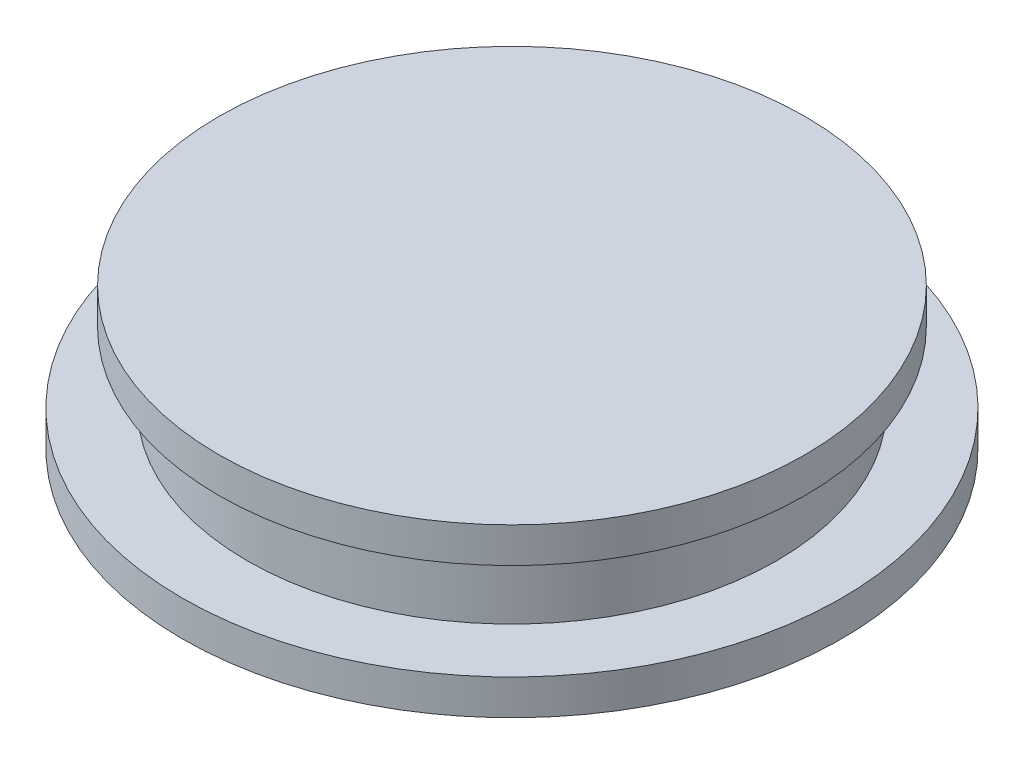
ISO-10303-21;
HEADER;
FILE_DESCRIPTION(('STEP AP214'),'2;1');
FILE_NAME('part.step','',(''),(''),'','','');
FILE_SCHEMA(('AUTOMOTIVE_DESIGN { 1 0 10303 214 1 1 1 1 }'));
ENDSEC;
DATA;
#1=APPLICATION_CONTEXT('core data for automotive mechanical design processes');
#2=APPLICATION_PROTOCOL_DEFINITION('international standard','automotive_design',2000,#1);
#3=PRODUCT_CONTEXT('',#1,'mechanical');
#4=PRODUCT('Part','Part','',(#3));
#5=PRODUCT_RELATED_PRODUCT_CATEGORY('part','',(#4));
#6=PRODUCT_DEFINITION_FORMATION('','',#4);
#7=PRODUCT_DEFINITION_CONTEXT('part definition',#1,'design');
#8=PRODUCT_DEFINITION('design','',#6,#7);
#9=PRODUCT_DEFINITION_SHAPE('','',#8);
#10=(LENGTH_UNIT() NAMED_UNIT(*) SI_UNIT(.MILLI.,.METRE.));
#11=(NAMED_UNIT(*) PLANE_ANGLE_UNIT() SI_UNIT($,.RADIAN.));
#12=(NAMED_UNIT(*) SI_UNIT($,.STERADIAN.) SOLID_ANGLE_UNIT());
#13=UNCERTAINTY_MEASURE_WITH_UNIT(LENGTH_MEASURE(1.E-05),#10,'distance_accuracy_value','');
#14=(GEOMETRIC_REPRESENTATION_CONTEXT(3) GLOBAL_UNCERTAINTY_ASSIGNED_CONTEXT((#13)) GLOBAL_UNIT_ASSIGNED_CONTEXT((#10,
#11,#12)) REPRESENTATION_CONTEXT('',''));
#15=CARTESIAN_POINT('',(0.,0.,0.));
#16=DIRECTION('',(0.,0.,1.));
#17=DIRECTION('',(1.,0.,0.));
#18=AXIS2_PLACEMENT_3D('',#15,#16,#17);
#19=CARTESIAN_POINT('',(0.,2.,0.));
#20=DIRECTION('',(0.,-1.,0.));
#21=DIRECTION('',(0.,0.,-1.));
#22=AXIS2_PLACEMENT_3D('',#19,#20,#21);
#23=CYLINDRICAL_SURFACE('',#22,18.669);
#24=CARTESIAN_POINT('',(0.,2.,0.));
#25=DIRECTION('',(0.,1.,0.));
#26=DIRECTION('',(0.,0.,1.));
#27=AXIS2_PLACEMENT_3D('',#24,#25,#26);
#28=CIRCLE('',#27,18.669);
#29=CARTESIAN_POINT('',(0.,2.,18.669));
#30=VERTEX_POINT('',#29);
#31=EDGE_CURVE('E48',#30,#30,#28,.T.);
#32=ORIENTED_EDGE('',*,*,#31,.F.);
#33=EDGE_LOOP('',(#32));
#34=FACE_BOUND('',#33,.T.);
#35=CARTESIAN_POINT('',(0.,0.,0.));
#36=DIRECTION('',(0.,1.,0.));
#37=DIRECTION('',(0.,0.,1.));
#38=AXIS2_PLACEMENT_3D('',#35,#36,#37);
#39=CIRCLE('',#38,18.669);
#40=CARTESIAN_POINT('',(0.,0.,18.669));
#41=VERTEX_POINT('',#40);
#42=EDGE_CURVE('E42',#41,#41,#39,.T.);
#43=ORIENTED_EDGE('',*,*,#42,.T.);
#44=EDGE_LOOP('',(#43));
#45=FACE_BOUND('',#44,.T.);
#46=ADVANCED_FACE('F39',(#34,#45),#23,.T.);
#47=CARTESIAN_POINT('',(0.,2.,0.));
#48=DIRECTION('',(0.,1.,0.));
#49=DIRECTION('',(0.,0.,1.));
#50=AXIS2_PLACEMENT_3D('',#47,#48,#49);
#51=PLANE('',#50);
#52=CARTESIAN_POINT('',(0.,2.,0.));
#53=DIRECTION('',(0.,1.,0.));
#54=DIRECTION('',(0.,0.,1.));
#55=AXIS2_PLACEMENT_3D('',#52,#53,#54);
#56=CIRCLE('',#55,15.);
#57=CARTESIAN_POINT('',(0.,2.,15.));
#58=VERTEX_POINT('',#57);
#59=EDGE_CURVE('E11',#58,#58,#56,.T.);
#60=ORIENTED_EDGE('',*,*,#59,.F.);
#61=EDGE_LOOP('',(#60));
#62=FACE_BOUND('',#61,.T.);
#63=ORIENTED_EDGE('',*,*,#31,.T.);
#64=EDGE_LOOP('',(#63));
#65=FACE_BOUND('',#64,.T.);
#66=ADVANCED_FACE('F225',(#62,#65),#51,.T.);
#67=CARTESIAN_POINT('',(0.,0.,0.));
#68=DIRECTION('',(0.,1.,0.));
#69=DIRECTION('',(0.,0.,1.));
#70=AXIS2_PLACEMENT_3D('',#67,#68,#69);
#71=PLANE('',#70);
#72=ORIENTED_EDGE('',*,*,#42,.F.);
#73=EDGE_LOOP('',(#72));
#74=FACE_BOUND('',#73,.T.);
#75=DIRECTION('',(0.,0.,1.));
#76=VECTOR('',#75,1.);
#77=CARTESIAN_POINT('',(5.461,0.,-5.461));
#78=LINE('',#77,#76);
#79=CARTESIAN_POINT('',(5.461,0.,-5.461));
#80=VERTEX_POINT('',#79);
#81=CARTESIAN_POINT('',(5.461,0.,5.461));
#82=VERTEX_POINT('',#81);
#83=EDGE_CURVE('E114',#80,#82,#78,.T.);
#84=ORIENTED_EDGE('',*,*,#83,.F.);
#85=DIRECTION('',(1.,0.,0.));
#86=VECTOR('',#85,1.);
#87=CARTESIAN_POINT('',(-5.461,0.,-5.461));
#88=LINE('',#87,#86);
#89=CARTESIAN_POINT('',(-5.461,0.,-5.461));
#90=VERTEX_POINT('',#89);
#91=EDGE_CURVE('E135',#90,#80,#88,.T.);
#92=ORIENTED_EDGE('',*,*,#91,.F.);
#93=DIRECTION('',(0.,0.,-1.));
#94=VECTOR('',#93,1.);
#95=CARTESIAN_POINT('',(-5.461,0.,-5.461));
#96=LINE('',#95,#94);
#97=CARTESIAN_POINT('',(-5.461,0.,5.461));
#98=VERTEX_POINT('',#97);
#99=EDGE_CURVE('E139',#98,#90,#96,.T.);
#100=ORIENTED_EDGE('',*,*,#99,.F.);
#101=DIRECTION('',(-1.,0.,0.));
#102=VECTOR('',#101,1.);
#103=CARTESIAN_POINT('',(-5.461,0.,5.461));
#104=LINE('',#103,#102);
#105=EDGE_CURVE('E148',#82,#98,#104,.T.);
#106=ORIENTED_EDGE('',*,*,#105,.F.);
#107=EDGE_LOOP('',(#84,#92,#100,#106));
#108=FACE_BOUND('',#107,.T.);
#109=ADVANCED_FACE('F221',(#74,#108),#71,.F.);
#110=CARTESIAN_POINT('',(0.,6.,0.));
#111=DIRECTION('',(0.,-1.,0.));
#112=DIRECTION('',(0.,0.,-1.));
#113=AXIS2_PLACEMENT_3D('',#110,#111,#112);
#114=CYLINDRICAL_SURFACE('',#113,15.);
#115=CARTESIAN_POINT('',(0.,6.,0.));
#116=DIRECTION('',(0.,1.,0.));
#117=DIRECTION('',(0.,0.,1.));
#118=AXIS2_PLACEMENT_3D('',#115,#116,#117);
#119=CIRCLE('',#118,15.);
#120=CARTESIAN_POINT('',(0.,6.,15.));
#121=VERTEX_POINT('',#120);
#122=EDGE_CURVE('E206',#121,#121,#119,.T.);
#123=ORIENTED_EDGE('',*,*,#122,.F.);
#124=EDGE_LOOP('',(#123));
#125=FACE_BOUND('',#124,.T.);
#126=ORIENTED_EDGE('',*,*,#59,.T.);
#127=EDGE_LOOP('',(#126));
#128=FACE_BOUND('',#127,.T.);
#129=ADVANCED_FACE('F224',(#125,#128),#114,.T.);
#130=CARTESIAN_POINT('',(0.,8.,0.));
#131=DIRECTION('',(0.,-1.,0.));
#132=DIRECTION('',(0.,0.,-1.));
#133=AXIS2_PLACEMENT_3D('',#130,#131,#132);
#134=CYLINDRICAL_SURFACE('',#133,16.6);
#135=CARTESIAN_POINT('',(0.,8.,0.));
#136=DIRECTION('',(0.,1.,0.));
#137=DIRECTION('',(0.,0.,1.));
#138=AXIS2_PLACEMENT_3D('',#135,#136,#137);
#139=CIRCLE('',#138,16.6);
#140=CARTESIAN_POINT('',(0.,8.,16.6));
#141=VERTEX_POINT('',#140);
#142=EDGE_CURVE('E202',#141,#141,#139,.T.);
#143=ORIENTED_EDGE('',*,*,#142,.F.);
#144=EDGE_LOOP('',(#143));
#145=FACE_BOUND('',#144,.T.);
#146=CARTESIAN_POINT('',(0.,6.,0.));
#147=DIRECTION('',(0.,1.,0.));
#148=DIRECTION('',(0.,0.,1.));
#149=AXIS2_PLACEMENT_3D('',#146,#147,#148);
#150=CIRCLE('',#149,16.6);
#151=CARTESIAN_POINT('',(0.,6.,16.6));
#152=VERTEX_POINT('',#151);
#153=EDGE_CURVE('E193',#152,#152,#150,.T.);
#154=ORIENTED_EDGE('',*,*,#153,.T.);
#155=EDGE_LOOP('',(#154));
#156=FACE_BOUND('',#155,.T.);
#157=ADVANCED_FACE('F253',(#145,#156),#134,.T.);
#158=CARTESIAN_POINT('',(0.,8.,0.));
#159=DIRECTION('',(0.,1.,0.));
#160=DIRECTION('',(0.,0.,1.));
#161=AXIS2_PLACEMENT_3D('',#158,#159,#160);
#162=PLANE('',#161);
#163=ORIENTED_EDGE('',*,*,#142,.T.);
#164=EDGE_LOOP('',(#163));
#165=FACE_BOUND('',#164,.T.);
#166=ADVANCED_FACE('F257',(#165),#162,.T.);
#167=CARTESIAN_POINT('',(0.,6.,0.));
#168=DIRECTION('',(0.,1.,0.));
#169=DIRECTION('',(0.,0.,1.));
#170=AXIS2_PLACEMENT_3D('',#167,#168,#169);
#171=PLANE('',#170);
#172=ORIENTED_EDGE('',*,*,#122,.T.);
#173=EDGE_LOOP('',(#172));
#174=FACE_BOUND('',#173,.T.);
#175=ORIENTED_EDGE('',*,*,#153,.F.);
#176=EDGE_LOOP('',(#175));
#177=FACE_BOUND('',#176,.T.);
#178=ADVANCED_FACE('F259',(#174,#177),#171,.F.);
#179=CARTESIAN_POINT('',(0.,1.,0.));
#180=DIRECTION('',(0.,-1.,0.));
#181=DIRECTION('',(0.,0.,-1.));
#182=AXIS2_PLACEMENT_3D('',#179,#180,#181);
#183=PLANE('',#182);
#184=DIRECTION('',(1.,0.,0.));
#185=VECTOR('',#184,1.);
#186=CARTESIAN_POINT('',(-5.461,1.,-5.461));
#187=LINE('',#186,#185);
#188=CARTESIAN_POINT('',(-5.461,1.,-5.461));
#189=VERTEX_POINT('',#188);
#190=CARTESIAN_POINT('',(5.461,1.,-5.461));
#191=VERTEX_POINT('',#190);
#192=EDGE_CURVE('E120',#189,#191,#187,.T.);
#193=ORIENTED_EDGE('',*,*,#192,.T.);
#194=DIRECTION('',(0.,0.,1.));
#195=VECTOR('',#194,1.);
#196=CARTESIAN_POINT('',(5.461,1.,-5.461));
#197=LINE('',#196,#195);
#198=CARTESIAN_POINT('',(5.461,1.,5.461));
#199=VERTEX_POINT('',#198);
#200=EDGE_CURVE('E111',#191,#199,#197,.T.);
#201=ORIENTED_EDGE('',*,*,#200,.T.);
#202=DIRECTION('',(-1.,0.,0.));
#203=VECTOR('',#202,1.);
#204=CARTESIAN_POINT('',(-5.461,1.,5.461));
#205=LINE('',#204,#203);
#206=CARTESIAN_POINT('',(-5.461,1.,5.461));
#207=VERTEX_POINT('',#206);
#208=EDGE_CURVE('E124',#199,#207,#205,.T.);
#209=ORIENTED_EDGE('',*,*,#208,.T.);
#210=DIRECTION('',(0.,0.,-1.));
#211=VECTOR('',#210,1.);
#212=CARTESIAN_POINT('',(-5.461,1.,-5.461));
#213=LINE('',#212,#211);
#214=EDGE_CURVE('E129',#207,#189,#213,.T.);
#215=ORIENTED_EDGE('',*,*,#214,.T.);
#216=EDGE_LOOP('',(#193,#201,#209,#215));
#217=FACE_BOUND('',#216,.T.);
#218=DIRECTION('',(0.,0.,-1.));
#219=VECTOR('',#218,1.);
#220=CARTESIAN_POINT('',(-6.5405,1.,6.5405));
#221=LINE('',#220,#219);
#222=CARTESIAN_POINT('',(-6.5405,1.,6.5405));
#223=VERTEX_POINT('',#222);
#224=CARTESIAN_POINT('',(-6.5405,1.,-6.5405));
#225=VERTEX_POINT('',#224);
#226=EDGE_CURVE('E64',#223,#225,#221,.T.);
#227=ORIENTED_EDGE('',*,*,#226,.F.);
#228=DIRECTION('',(-1.,0.,0.));
#229=VECTOR('',#228,1.);
#230=CARTESIAN_POINT('',(-6.5405,1.,6.5405));
#231=LINE('',#230,#229);
#232=CARTESIAN_POINT('',(6.5405,1.,6.5405));
#233=VERTEX_POINT('',#232);
#234=EDGE_CURVE('E170',#233,#223,#231,.T.);
#235=ORIENTED_EDGE('',*,*,#234,.F.);
#236=DIRECTION('',(0.,0.,1.));
#237=VECTOR('',#236,1.);
#238=CARTESIAN_POINT('',(6.5405,1.,6.5405));
#239=LINE('',#238,#237);
#240=CARTESIAN_POINT('',(6.5405,1.,-6.5405));
#241=VERTEX_POINT('',#240);
#242=EDGE_CURVE('E166',#241,#233,#239,.T.);
#243=ORIENTED_EDGE('',*,*,#242,.F.);
#244=DIRECTION('',(1.,0.,0.));
#245=VECTOR('',#244,1.);
#246=CARTESIAN_POINT('',(-6.5405,1.,-6.5405));
#247=LINE('',#246,#245);
#248=EDGE_CURVE('E56',#225,#241,#247,.T.);
#249=ORIENTED_EDGE('',*,*,#248,.F.);
#250=EDGE_LOOP('',(#227,#235,#243,#249));
#251=FACE_BOUND('',#250,.T.);
#252=ADVANCED_FACE('F131',(#217,#251),#183,.F.);
#253=CARTESIAN_POINT('',(5.461,1.,-5.461));
#254=DIRECTION('',(1.,0.,0.));
#255=DIRECTION('',(0.,0.,-1.));
#256=AXIS2_PLACEMENT_3D('',#253,#254,#255);
#257=PLANE('',#256);
#258=ORIENTED_EDGE('',*,*,#83,.T.);
#259=DIRECTION('',(0.,-1.,0.));
#260=VECTOR('',#259,1.);
#261=CARTESIAN_POINT('',(5.461,1.,5.461));
#262=LINE('',#261,#260);
#263=EDGE_CURVE('E107',#199,#82,#262,.T.);
#264=ORIENTED_EDGE('',*,*,#263,.F.);
#265=ORIENTED_EDGE('',*,*,#200,.F.);
#266=DIRECTION('',(0.,-1.,0.));
#267=VECTOR('',#266,1.);
#268=CARTESIAN_POINT('',(5.461,1.,-5.461));
#269=LINE('',#268,#267);
#270=EDGE_CURVE('E154',#191,#80,#269,.T.);
#271=ORIENTED_EDGE('',*,*,#270,.T.);
#272=EDGE_LOOP('',(#258,#264,#265,#271));
#273=FACE_BOUND('',#272,.T.);
#274=ADVANCED_FACE('F109',(#273),#257,.F.);
#275=CARTESIAN_POINT('',(-5.461,1.,-5.461));
#276=DIRECTION('',(0.,0.,-1.));
#277=DIRECTION('',(-1.,0.,0.));
#278=AXIS2_PLACEMENT_3D('',#275,#276,#277);
#279=PLANE('',#278);
#280=ORIENTED_EDGE('',*,*,#91,.T.);
#281=ORIENTED_EDGE('',*,*,#270,.F.);
#282=ORIENTED_EDGE('',*,*,#192,.F.);
#283=DIRECTION('',(0.,-1.,0.));
#284=VECTOR('',#283,1.);
#285=CARTESIAN_POINT('',(-5.461,1.,-5.461));
#286=LINE('',#285,#284);
#287=EDGE_CURVE('E157',#189,#90,#286,.T.);
#288=ORIENTED_EDGE('',*,*,#287,.T.);
#289=EDGE_LOOP('',(#280,#281,#282,#288));
#290=FACE_BOUND('',#289,.T.);
#291=ADVANCED_FACE('F231',(#290),#279,.F.);
#292=CARTESIAN_POINT('',(-5.461,1.,-5.461));
#293=DIRECTION('',(-1.,0.,0.));
#294=DIRECTION('',(0.,0.,1.));
#295=AXIS2_PLACEMENT_3D('',#292,#293,#294);
#296=PLANE('',#295);
#297=ORIENTED_EDGE('',*,*,#99,.T.);
#298=ORIENTED_EDGE('',*,*,#287,.F.);
#299=ORIENTED_EDGE('',*,*,#214,.F.);
#300=DIRECTION('',(0.,-1.,0.));
#301=VECTOR('',#300,1.);
#302=CARTESIAN_POINT('',(-5.461,1.,5.461));
#303=LINE('',#302,#301);
#304=EDGE_CURVE('E119',#207,#98,#303,.T.);
#305=ORIENTED_EDGE('',*,*,#304,.T.);
#306=EDGE_LOOP('',(#297,#298,#299,#305));
#307=FACE_BOUND('',#306,.T.);
#308=ADVANCED_FACE('F229',(#307),#296,.F.);
#309=CARTESIAN_POINT('',(-5.461,1.,5.461));
#310=DIRECTION('',(0.,0.,1.));
#311=DIRECTION('',(1.,0.,0.));
#312=AXIS2_PLACEMENT_3D('',#309,#310,#311);
#313=PLANE('',#312);
#314=ORIENTED_EDGE('',*,*,#105,.T.);
#315=ORIENTED_EDGE('',*,*,#304,.F.);
#316=ORIENTED_EDGE('',*,*,#208,.F.);
#317=ORIENTED_EDGE('',*,*,#263,.T.);
#318=EDGE_LOOP('',(#314,#315,#316,#317));
#319=FACE_BOUND('',#318,.T.);
#320=ADVANCED_FACE('F125',(#319),#313,.F.);
#321=CARTESIAN_POINT('',(0.,7.,0.));
#322=DIRECTION('',(0.,1.,0.));
#323=DIRECTION('',(0.,0.,1.));
#324=AXIS2_PLACEMENT_3D('',#321,#322,#323);
#325=PLANE('',#324);
#326=DIRECTION('',(0.,0.,1.));
#327=VECTOR('',#326,1.);
#328=CARTESIAN_POINT('',(6.5405,7.,-6.5405));
#329=LINE('',#328,#327);
#330=CARTESIAN_POINT('',(6.5405,7.,-6.5405));
#331=VERTEX_POINT('',#330);
#332=CARTESIAN_POINT('',(6.5405,7.,6.5405));
#333=VERTEX_POINT('',#332);
#334=EDGE_CURVE('E173',#331,#333,#329,.T.);
#335=ORIENTED_EDGE('',*,*,#334,.T.);
#336=DIRECTION('',(-1.,0.,0.));
#337=VECTOR('',#336,1.);
#338=CARTESIAN_POINT('',(-6.5405,7.,6.5405));
#339=LINE('',#338,#337);
#340=CARTESIAN_POINT('',(-6.5405,7.,6.5405));
#341=VERTEX_POINT('',#340);
#342=EDGE_CURVE('E177',#333,#341,#339,.T.);
#343=ORIENTED_EDGE('',*,*,#342,.T.);
#344=DIRECTION('',(0.,0.,-1.));
#345=VECTOR('',#344,1.);
#346=CARTESIAN_POINT('',(-6.5405,7.,-6.5405));
#347=LINE('',#346,#345);
#348=CARTESIAN_POINT('',(-6.5405,7.,-6.5405));
#349=VERTEX_POINT('',#348);
#350=EDGE_CURVE('E181',#341,#349,#347,.T.);
#351=ORIENTED_EDGE('',*,*,#350,.T.);
#352=DIRECTION('',(1.,0.,0.));
#353=VECTOR('',#352,1.);
#354=CARTESIAN_POINT('',(-6.5405,7.,-6.5405));
#355=LINE('',#354,#353);
#356=EDGE_CURVE('E185',#349,#331,#355,.T.);
#357=ORIENTED_EDGE('',*,*,#356,.T.);
#358=EDGE_LOOP('',(#335,#343,#351,#357));
#359=FACE_BOUND('',#358,.T.);
#360=ADVANCED_FACE('F275',(#359),#325,.F.);
#361=CARTESIAN_POINT('',(-6.5405,7.,6.5405));
#362=DIRECTION('',(0.,0.,1.));
#363=DIRECTION('',(1.,0.,0.));
#364=AXIS2_PLACEMENT_3D('',#361,#362,#363);
#365=PLANE('',#364);
#366=ORIENTED_EDGE('',*,*,#234,.T.);
#367=DIRECTION('',(0.,-1.,0.));
#368=VECTOR('',#367,1.);
#369=CARTESIAN_POINT('',(-6.5405,7.,6.5405));
#370=LINE('',#369,#368);
#371=EDGE_CURVE('E197',#341,#223,#370,.T.);
#372=ORIENTED_EDGE('',*,*,#371,.F.);
#373=ORIENTED_EDGE('',*,*,#342,.F.);
#374=DIRECTION('',(0.,-1.,0.));
#375=VECTOR('',#374,1.);
#376=CARTESIAN_POINT('',(6.5405,7.,6.5405));
#377=LINE('',#376,#375);
#378=EDGE_CURVE('E189',#333,#233,#377,.T.);
#379=ORIENTED_EDGE('',*,*,#378,.T.);
#380=EDGE_LOOP('',(#366,#372,#373,#379));
#381=FACE_BOUND('',#380,.T.);
#382=ADVANCED_FACE('F271',(#381),#365,.F.);
#383=CARTESIAN_POINT('',(-6.5405,7.,-6.5405));
#384=DIRECTION('',(-1.,0.,0.));
#385=DIRECTION('',(0.,0.,1.));
#386=AXIS2_PLACEMENT_3D('',#383,#384,#385);
#387=PLANE('',#386);
#388=ORIENTED_EDGE('',*,*,#226,.T.);
#389=DIRECTION('',(0.,-1.,0.));
#390=VECTOR('',#389,1.);
#391=CARTESIAN_POINT('',(-6.5405,7.,-6.5405));
#392=LINE('',#391,#390);
#393=EDGE_CURVE('E194',#349,#225,#392,.T.);
#394=ORIENTED_EDGE('',*,*,#393,.F.);
#395=ORIENTED_EDGE('',*,*,#350,.F.);
#396=ORIENTED_EDGE('',*,*,#371,.T.);
#397=EDGE_LOOP('',(#388,#394,#395,#396));
#398=FACE_BOUND('',#397,.T.);
#399=ADVANCED_FACE('F274',(#398),#387,.F.);
#400=CARTESIAN_POINT('',(-6.5405,7.,-6.5405));
#401=DIRECTION('',(0.,0.,-1.));
#402=DIRECTION('',(-1.,0.,0.));
#403=AXIS2_PLACEMENT_3D('',#400,#401,#402);
#404=PLANE('',#403);
#405=ORIENTED_EDGE('',*,*,#248,.T.);
#406=DIRECTION('',(0.,-1.,0.));
#407=VECTOR('',#406,1.);
#408=CARTESIAN_POINT('',(6.5405,7.,-6.5405));
#409=LINE('',#408,#407);
#410=EDGE_CURVE('E190',#331,#241,#409,.T.);
#411=ORIENTED_EDGE('',*,*,#410,.F.);
#412=ORIENTED_EDGE('',*,*,#356,.F.);
#413=ORIENTED_EDGE('',*,*,#393,.T.);
#414=EDGE_LOOP('',(#405,#411,#412,#413));
#415=FACE_BOUND('',#414,.T.);
#416=ADVANCED_FACE('F269',(#415),#404,.F.);
#417=CARTESIAN_POINT('',(6.5405,7.,-6.5405));
#418=DIRECTION('',(1.,0.,0.));
#419=DIRECTION('',(0.,0.,-1.));
#420=AXIS2_PLACEMENT_3D('',#417,#418,#419);
#421=PLANE('',#420);
#422=ORIENTED_EDGE('',*,*,#242,.T.);
#423=ORIENTED_EDGE('',*,*,#378,.F.);
#424=ORIENTED_EDGE('',*,*,#334,.F.);
#425=ORIENTED_EDGE('',*,*,#410,.T.);
#426=EDGE_LOOP('',(#422,#423,#424,#425));
#427=FACE_BOUND('',#426,.T.);
#428=ADVANCED_FACE('F266',(#427),#421,.F.);
#429=CLOSED_SHELL('',(#46,#66,#109,#129,#157,#166,#178,#252,#274,#291,#308,#320,#360,#382,#399,
#416,#428));
#430=MANIFOLD_SOLID_BREP('B2',#429);
#431=ADVANCED_BREP_SHAPE_REPRESENTATION('',(#18,#430),#14);
#432=SHAPE_DEFINITION_REPRESENTATION(#9,#431);
ENDSEC;
END-ISO-10303-21;
